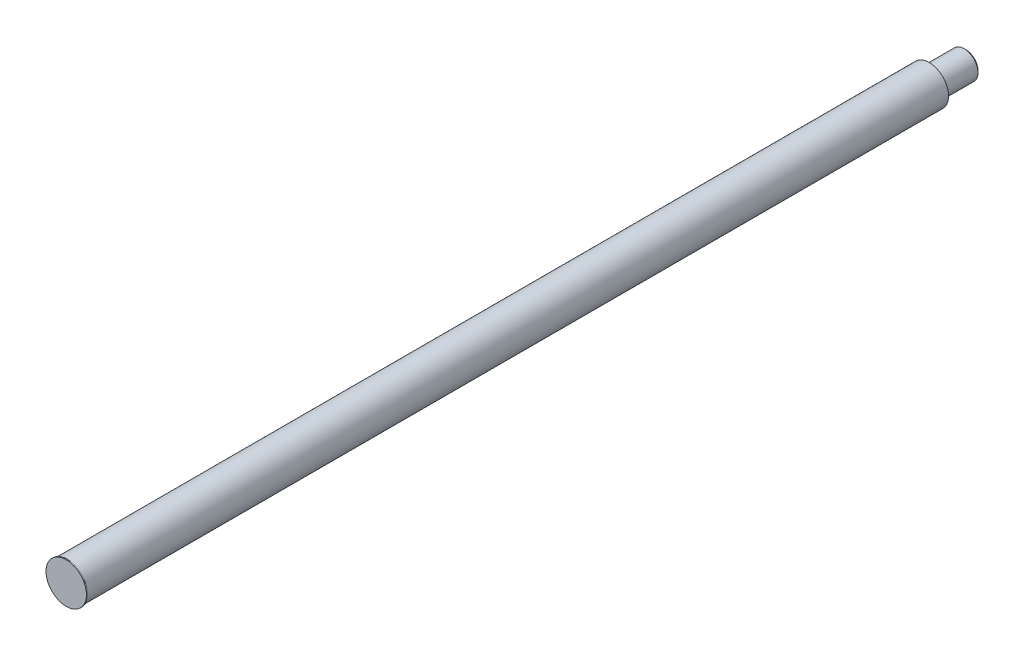
ISO-10303-21;
HEADER;
FILE_DESCRIPTION(('STEP AP214'),'2;1');
FILE_NAME('part.step','',(''),(''),'','','');
FILE_SCHEMA(('AUTOMOTIVE_DESIGN { 1 0 10303 214 1 1 1 1 }'));
ENDSEC;
DATA;
#1=APPLICATION_CONTEXT('core data for automotive mechanical design processes');
#2=APPLICATION_PROTOCOL_DEFINITION('international standard','automotive_design',2000,#1);
#3=PRODUCT_CONTEXT('',#1,'mechanical');
#4=PRODUCT('Part','Part','',(#3));
#5=PRODUCT_RELATED_PRODUCT_CATEGORY('part','',(#4));
#6=PRODUCT_DEFINITION_FORMATION('','',#4);
#7=PRODUCT_DEFINITION_CONTEXT('part definition',#1,'design');
#8=PRODUCT_DEFINITION('design','',#6,#7);
#9=PRODUCT_DEFINITION_SHAPE('','',#8);
#10=(LENGTH_UNIT() NAMED_UNIT(*) SI_UNIT(.MILLI.,.METRE.));
#11=(NAMED_UNIT(*) PLANE_ANGLE_UNIT() SI_UNIT($,.RADIAN.));
#12=(NAMED_UNIT(*) SI_UNIT($,.STERADIAN.) SOLID_ANGLE_UNIT());
#13=UNCERTAINTY_MEASURE_WITH_UNIT(LENGTH_MEASURE(1.E-05),#10,'distance_accuracy_value','');
#14=(GEOMETRIC_REPRESENTATION_CONTEXT(3) GLOBAL_UNCERTAINTY_ASSIGNED_CONTEXT((#13)) GLOBAL_UNIT_ASSIGNED_CONTEXT((#10,
#11,#12)) REPRESENTATION_CONTEXT('',''));
#15=CARTESIAN_POINT('',(0.,0.,0.));
#16=DIRECTION('',(0.,0.,1.));
#17=DIRECTION('',(1.,0.,0.));
#18=AXIS2_PLACEMENT_3D('',#15,#16,#17);
#19=CARTESIAN_POINT('',(0.,19.5000000000001,-1467.1002));
#20=DIRECTION('',(0.,0.,-1.));
#21=DIRECTION('',(-1.,0.,0.));
#22=AXIS2_PLACEMENT_3D('',#19,#20,#21);
#23=PLANE('',#22);
#24=CARTESIAN_POINT('',(0.,0.,-1467.1002));
#25=DIRECTION('',(0.,0.,1.));
#26=DIRECTION('',(1.,0.,0.));
#27=AXIS2_PLACEMENT_3D('',#24,#25,#26);
#28=CIRCLE('',#27,19.5000000000001);
#29=CARTESIAN_POINT('',(19.5000000000001,0.,-1467.1002));
#30=VERTEX_POINT('',#29);
#31=EDGE_CURVE('E18',#30,#30,#28,.T.);
#32=ORIENTED_EDGE('',*,*,#31,.F.);
#33=EDGE_LOOP('',(#32));
#34=FACE_BOUND('',#33,.T.);
#35=ADVANCED_FACE('F15',(#34),#23,.T.);
#36=CARTESIAN_POINT('',(0.,0.,-1464.1002));
#37=DIRECTION('',(0.,0.,1.));
#38=DIRECTION('',(1.,0.,0.));
#39=AXIS2_PLACEMENT_3D('',#36,#37,#38);
#40=CONICAL_SURFACE('',#39,22.5000000000001,0.785398163397466);
#41=ORIENTED_EDGE('',*,*,#31,.T.);
#42=EDGE_LOOP('',(#41));
#43=FACE_BOUND('',#42,.T.);
#44=CARTESIAN_POINT('',(0.,0.,-1464.1002));
#45=DIRECTION('',(0.,0.,-1.));
#46=DIRECTION('',(-1.,0.,0.));
#47=AXIS2_PLACEMENT_3D('',#44,#45,#46);
#48=CIRCLE('',#47,22.5000000000001);
#49=CARTESIAN_POINT('',(-22.5000000000001,0.,-1464.1002));
#50=VERTEX_POINT('',#49);
#51=EDGE_CURVE('E30',#50,#50,#48,.F.);
#52=ORIENTED_EDGE('',*,*,#51,.F.);
#53=EDGE_LOOP('',(#52));
#54=FACE_BOUND('',#53,.T.);
#55=ADVANCED_FACE('F49',(#43,#54),#40,.T.);
#56=CARTESIAN_POINT('',(0.,0.,0.));
#57=DIRECTION('',(0.,0.,1.));
#58=DIRECTION('',(1.,0.,0.));
#59=AXIS2_PLACEMENT_3D('',#56,#57,#58);
#60=PLANE('',#59);
#61=CARTESIAN_POINT('',(0.,0.,0.));
#62=DIRECTION('',(0.,0.,-1.));
#63=DIRECTION('',(-1.,0.,0.));
#64=AXIS2_PLACEMENT_3D('',#61,#62,#63);
#65=CIRCLE('',#64,33.);
#66=CARTESIAN_POINT('',(-33.,0.,0.));
#67=VERTEX_POINT('',#66);
#68=EDGE_CURVE('E38',#67,#67,#65,.T.);
#69=ORIENTED_EDGE('',*,*,#68,.F.);
#70=EDGE_LOOP('',(#69));
#71=FACE_BOUND('',#70,.T.);
#72=ADVANCED_FACE('F57',(#71),#60,.T.);
#73=CARTESIAN_POINT('',(0.,0.,0.));
#74=DIRECTION('',(0.,0.,-1.));
#75=DIRECTION('',(-1.,0.,0.));
#76=AXIS2_PLACEMENT_3D('',#73,#74,#75);
#77=CYLINDRICAL_SURFACE('',#76,22.5000000000001);
#78=CARTESIAN_POINT('',(0.,0.,-1410.1002));
#79=DIRECTION('',(0.,0.,-1.));
#80=DIRECTION('',(-1.,0.,0.));
#81=AXIS2_PLACEMENT_3D('',#78,#79,#80);
#82=CIRCLE('',#81,22.5000000000002);
#83=CARTESIAN_POINT('',(-22.5000000000002,0.,-1410.1002));
#84=VERTEX_POINT('',#83);
#85=EDGE_CURVE('E37',#84,#84,#82,.F.);
#86=ORIENTED_EDGE('',*,*,#85,.F.);
#87=EDGE_LOOP('',(#86));
#88=FACE_BOUND('',#87,.T.);
#89=ORIENTED_EDGE('',*,*,#51,.T.);
#90=EDGE_LOOP('',(#89));
#91=FACE_BOUND('',#90,.T.);
#92=ADVANCED_FACE('F80',(#88,#91),#77,.T.);
#93=CARTESIAN_POINT('',(0.,0.,0.));
#94=DIRECTION('',(0.,0.,-1.));
#95=DIRECTION('',(-1.,0.,0.));
#96=AXIS2_PLACEMENT_3D('',#93,#94,#95);
#97=CYLINDRICAL_SURFACE('',#96,33.);
#98=ORIENTED_EDGE('',*,*,#68,.T.);
#99=EDGE_LOOP('',(#98));
#100=FACE_BOUND('',#99,.T.);
#101=CARTESIAN_POINT('',(0.,0.,-1.6002));
#102=DIRECTION('',(0.,0.,-1.));
#103=DIRECTION('',(-1.,0.,0.));
#104=AXIS2_PLACEMENT_3D('',#101,#102,#103);
#105=CIRCLE('',#104,33.);
#106=CARTESIAN_POINT('',(-33.,0.,-1.6002));
#107=VERTEX_POINT('',#106);
#108=EDGE_CURVE('E35',#107,#107,#105,.T.);
#109=ORIENTED_EDGE('',*,*,#108,.F.);
#110=EDGE_LOOP('',(#109));
#111=FACE_BOUND('',#110,.T.);
#112=ADVANCED_FACE('F76',(#100,#111),#97,.T.);
#113=CARTESIAN_POINT('',(0.,0.,-1410.1002));
#114=DIRECTION('',(0.,0.,-1.));
#115=DIRECTION('',(-1.,0.,0.));
#116=AXIS2_PLACEMENT_3D('',#113,#114,#115);
#117=CONICAL_SURFACE('',#116,22.5000000000002,0.785398163397482);
#118=CARTESIAN_POINT('',(0.,0.,-1407.1002));
#119=DIRECTION('',(0.,0.,-1.));
#120=DIRECTION('',(-1.,0.,0.));
#121=AXIS2_PLACEMENT_3D('',#118,#119,#120);
#122=CIRCLE('',#121,19.5000000000001);
#123=CARTESIAN_POINT('',(-19.5000000000001,0.,-1407.1002));
#124=VERTEX_POINT('',#123);
#125=EDGE_CURVE('E27',#124,#124,#122,.F.);
#126=ORIENTED_EDGE('',*,*,#125,.F.);
#127=EDGE_LOOP('',(#126));
#128=FACE_BOUND('',#127,.T.);
#129=ORIENTED_EDGE('',*,*,#85,.T.);
#130=EDGE_LOOP('',(#129));
#131=FACE_BOUND('',#130,.T.);
#132=ADVANCED_FACE('F72',(#128,#131),#117,.T.);
#133=CARTESIAN_POINT('',(0.,33.,-1.6002));
#134=DIRECTION('',(0.,0.,-1.));
#135=DIRECTION('',(-1.,0.,0.));
#136=AXIS2_PLACEMENT_3D('',#133,#134,#135);
#137=PLANE('',#136);
#138=CARTESIAN_POINT('',(0.,0.,-1.6002));
#139=DIRECTION('',(0.,0.,-1.));
#140=DIRECTION('',(-1.,0.,0.));
#141=AXIS2_PLACEMENT_3D('',#138,#139,#140);
#142=CIRCLE('',#141,31.5);
#143=CARTESIAN_POINT('',(-31.5,0.,-1.6002));
#144=VERTEX_POINT('',#143);
#145=EDGE_CURVE('E22',#144,#144,#142,.T.);
#146=ORIENTED_EDGE('',*,*,#145,.F.);
#147=EDGE_LOOP('',(#146));
#148=FACE_BOUND('',#147,.T.);
#149=ORIENTED_EDGE('',*,*,#108,.T.);
#150=EDGE_LOOP('',(#149));
#151=FACE_BOUND('',#150,.T.);
#152=ADVANCED_FACE('F65',(#148,#151),#137,.T.);
#153=CARTESIAN_POINT('',(0.,31.5,-1407.1002));
#154=DIRECTION('',(0.,0.,-1.));
#155=DIRECTION('',(-1.,0.,0.));
#156=AXIS2_PLACEMENT_3D('',#153,#154,#155);
#157=PLANE('',#156);
#158=ORIENTED_EDGE('',*,*,#125,.T.);
#159=EDGE_LOOP('',(#158));
#160=FACE_BOUND('',#159,.T.);
#161=CARTESIAN_POINT('',(0.,0.,-1407.1002));
#162=DIRECTION('',(0.,0.,-1.));
#163=DIRECTION('',(-1.,0.,0.));
#164=AXIS2_PLACEMENT_3D('',#161,#162,#163);
#165=CIRCLE('',#164,31.5);
#166=CARTESIAN_POINT('',(-31.5,0.,-1407.1002));
#167=VERTEX_POINT('',#166);
#168=EDGE_CURVE('E10',#167,#167,#165,.F.);
#169=ORIENTED_EDGE('',*,*,#168,.F.);
#170=EDGE_LOOP('',(#169));
#171=FACE_BOUND('',#170,.T.);
#172=ADVANCED_FACE('F60',(#160,#171),#157,.T.);
#173=CARTESIAN_POINT('',(0.,0.,0.));
#174=DIRECTION('',(0.,0.,-1.));
#175=DIRECTION('',(-1.,0.,0.));
#176=AXIS2_PLACEMENT_3D('',#173,#174,#175);
#177=CYLINDRICAL_SURFACE('',#176,31.5);
#178=ORIENTED_EDGE('',*,*,#168,.T.);
#179=EDGE_LOOP('',(#178));
#180=FACE_BOUND('',#179,.T.);
#181=ORIENTED_EDGE('',*,*,#145,.T.);
#182=EDGE_LOOP('',(#181));
#183=FACE_BOUND('',#182,.T.);
#184=ADVANCED_FACE('F58',(#180,#183),#177,.T.);
#185=CLOSED_SHELL('',(#35,#55,#72,#92,#112,#132,#152,#172,#184));
#186=MANIFOLD_SOLID_BREP('B1',#185);
#187=ADVANCED_BREP_SHAPE_REPRESENTATION('',(#18,#186),#14);
#188=SHAPE_DEFINITION_REPRESENTATION(#9,#187);
ENDSEC;
END-ISO-10303-21;
